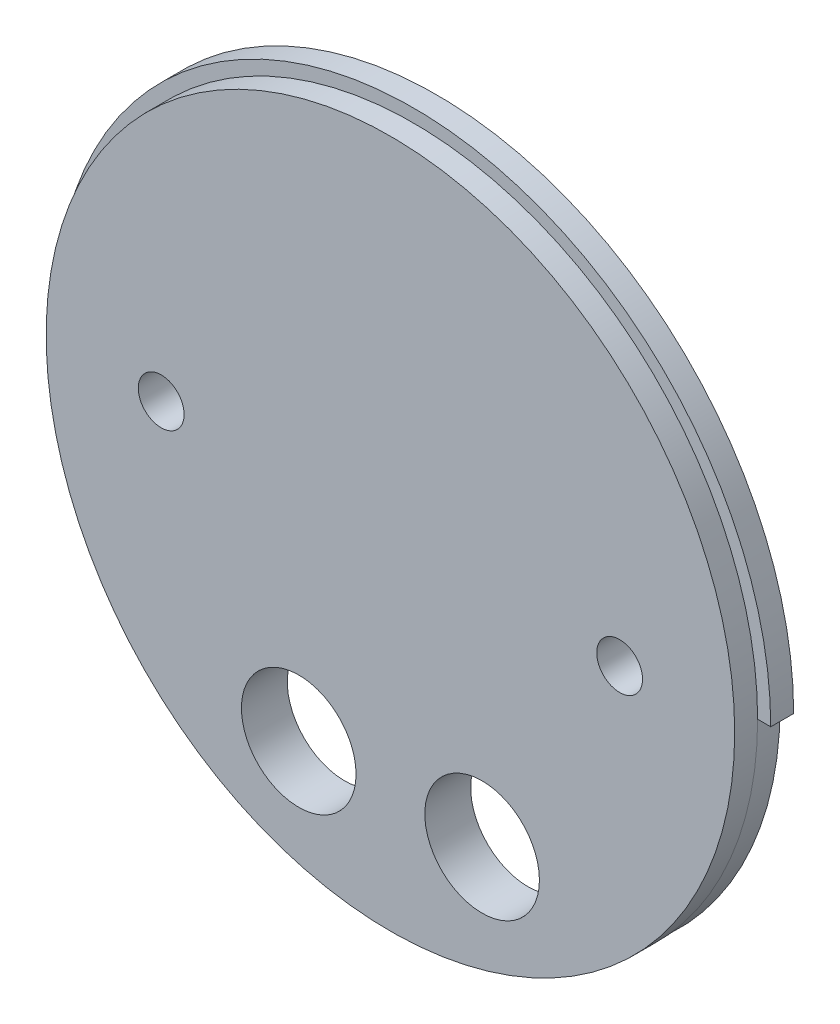
ISO-10303-21;
HEADER;
FILE_DESCRIPTION(('STEP AP214'),'2;1');
FILE_NAME('part.step','',(''),(''),'','','');
FILE_SCHEMA(('AUTOMOTIVE_DESIGN { 1 0 10303 214 1 1 1 1 }'));
ENDSEC;
DATA;
#1=APPLICATION_CONTEXT('core data for automotive mechanical design processes');
#2=APPLICATION_PROTOCOL_DEFINITION('international standard','automotive_design',2000,#1);
#3=PRODUCT_CONTEXT('',#1,'mechanical');
#4=PRODUCT('Part','Part','',(#3));
#5=PRODUCT_RELATED_PRODUCT_CATEGORY('part','',(#4));
#6=PRODUCT_DEFINITION_FORMATION('','',#4);
#7=PRODUCT_DEFINITION_CONTEXT('part definition',#1,'design');
#8=PRODUCT_DEFINITION('design','',#6,#7);
#9=PRODUCT_DEFINITION_SHAPE('','',#8);
#10=(LENGTH_UNIT() NAMED_UNIT(*) SI_UNIT(.MILLI.,.METRE.));
#11=(NAMED_UNIT(*) PLANE_ANGLE_UNIT() SI_UNIT($,.RADIAN.));
#12=(NAMED_UNIT(*) SI_UNIT($,.STERADIAN.) SOLID_ANGLE_UNIT());
#13=UNCERTAINTY_MEASURE_WITH_UNIT(LENGTH_MEASURE(1.E-05),#10,'distance_accuracy_value','');
#14=(GEOMETRIC_REPRESENTATION_CONTEXT(3) GLOBAL_UNCERTAINTY_ASSIGNED_CONTEXT((#13)) GLOBAL_UNIT_ASSIGNED_CONTEXT((#10,
#11,#12)) REPRESENTATION_CONTEXT('',''));
#15=CARTESIAN_POINT('',(0.,0.,0.));
#16=DIRECTION('',(0.,0.,1.));
#17=DIRECTION('',(1.,0.,0.));
#18=AXIS2_PLACEMENT_3D('',#15,#16,#17);
#19=CARTESIAN_POINT('',(0.,0.,3.175));
#20=DIRECTION('',(0.,0.,-1.));
#21=DIRECTION('',(-1.,0.,0.));
#22=AXIS2_PLACEMENT_3D('',#19,#20,#21);
#23=CYLINDRICAL_SURFACE('',#22,49.5046);
#24=CARTESIAN_POINT('',(0.,0.,3.175));
#25=DIRECTION('',(0.,0.,1.));
#26=DIRECTION('',(1.,0.,0.));
#27=AXIS2_PLACEMENT_3D('',#24,#25,#26);
#28=CIRCLE('',#27,49.5046);
#29=CARTESIAN_POINT('',(49.5046,0.,3.175));
#30=VERTEX_POINT('',#29);
#31=CARTESIAN_POINT('',(-49.5046,0.,3.175));
#32=VERTEX_POINT('',#31);
#33=EDGE_CURVE('E148',#30,#32,#28,.T.);
#34=ORIENTED_EDGE('',*,*,#33,.F.);
#35=DIRECTION('',(0.,0.,-1.));
#36=VECTOR('',#35,1.);
#37=CARTESIAN_POINT('',(49.5046,0.,3.175));
#38=LINE('',#37,#36);
#39=CARTESIAN_POINT('',(49.5046,0.,0.));
#40=VERTEX_POINT('',#39);
#41=EDGE_CURVE('E115',#30,#40,#38,.T.);
#42=ORIENTED_EDGE('',*,*,#41,.T.);
#43=CARTESIAN_POINT('',(0.,0.,0.));
#44=DIRECTION('',(0.,0.,1.));
#45=DIRECTION('',(1.,0.,0.));
#46=AXIS2_PLACEMENT_3D('',#43,#44,#45);
#47=CIRCLE('',#46,49.5046);
#48=CARTESIAN_POINT('',(-49.5046,0.,0.));
#49=VERTEX_POINT('',#48);
#50=EDGE_CURVE('E144',#40,#49,#47,.T.);
#51=ORIENTED_EDGE('',*,*,#50,.T.);
#52=DIRECTION('',(0.,0.,-1.));
#53=VECTOR('',#52,1.);
#54=CARTESIAN_POINT('',(-49.5046,0.,3.175));
#55=LINE('',#54,#53);
#56=EDGE_CURVE('E99',#49,#32,#55,.F.);
#57=ORIENTED_EDGE('',*,*,#56,.T.);
#58=EDGE_LOOP('',(#34,#42,#51,#57));
#59=FACE_BOUND('',#58,.T.);
#60=ADVANCED_FACE('F39',(#59),#23,.T.);
#61=CARTESIAN_POINT('',(0.,0.,3.175));
#62=DIRECTION('',(0.,0.,1.));
#63=DIRECTION('',(1.,0.,0.));
#64=AXIS2_PLACEMENT_3D('',#61,#62,#63);
#65=PLANE('',#64);
#66=DIRECTION('',(-1.,0.,0.));
#67=VECTOR('',#66,1.);
#68=CARTESIAN_POINT('',(47.625,0.,3.175));
#69=LINE('',#68,#67);
#70=CARTESIAN_POINT('',(47.6885,0.,3.175));
#71=VERTEX_POINT('',#70);
#72=EDGE_CURVE('E53',#30,#71,#69,.T.);
#73=ORIENTED_EDGE('',*,*,#72,.F.);
#74=ORIENTED_EDGE('',*,*,#33,.T.);
#75=DIRECTION('',(-1.,0.,0.));
#76=VECTOR('',#75,1.);
#77=CARTESIAN_POINT('',(-50.165,0.,3.175));
#78=LINE('',#77,#76);
#79=CARTESIAN_POINT('',(-47.6885,0.,3.175));
#80=VERTEX_POINT('',#79);
#81=EDGE_CURVE('E110',#80,#32,#78,.T.);
#82=ORIENTED_EDGE('',*,*,#81,.F.);
#83=CARTESIAN_POINT('',(0.,0.,3.175));
#84=DIRECTION('',(0.,0.,1.));
#85=DIRECTION('',(1.,0.,0.));
#86=AXIS2_PLACEMENT_3D('',#83,#84,#85);
#87=CIRCLE('',#86,47.6885);
#88=EDGE_CURVE('E46',#71,#80,#87,.T.);
#89=ORIENTED_EDGE('',*,*,#88,.F.);
#90=EDGE_LOOP('',(#73,#74,#82,#89));
#91=FACE_BOUND('',#90,.T.);
#92=ADVANCED_FACE('F155',(#91),#65,.T.);
#93=CARTESIAN_POINT('',(0.,0.,0.));
#94=DIRECTION('',(0.,0.,1.));
#95=DIRECTION('',(1.,0.,0.));
#96=AXIS2_PLACEMENT_3D('',#93,#94,#95);
#97=PLANE('',#96);
#98=CARTESIAN_POINT('',(-31.75,0.,0.));
#99=DIRECTION('',(0.,0.,1.));
#100=DIRECTION('',(1.,0.,0.));
#101=AXIS2_PLACEMENT_3D('',#98,#99,#100);
#102=CIRCLE('',#101,3.17500000000001);
#103=CARTESIAN_POINT('',(-28.575,0.,0.));
#104=VERTEX_POINT('',#103);
#105=EDGE_CURVE('E118',#104,#104,#102,.T.);
#106=ORIENTED_EDGE('',*,*,#105,.T.);
#107=EDGE_LOOP('',(#106));
#108=FACE_BOUND('',#107,.T.);
#109=CARTESIAN_POINT('',(12.7,-31.2353524431853,0.));
#110=DIRECTION('',(0.,0.,1.));
#111=DIRECTION('',(1.,0.,0.));
#112=AXIS2_PLACEMENT_3D('',#109,#110,#111);
#113=CIRCLE('',#112,7.9375);
#114=CARTESIAN_POINT('',(20.6375,-31.2353524431853,0.));
#115=VERTEX_POINT('',#114);
#116=EDGE_CURVE('E126',#115,#115,#113,.T.);
#117=ORIENTED_EDGE('',*,*,#116,.T.);
#118=EDGE_LOOP('',(#117));
#119=FACE_BOUND('',#118,.T.);
#120=CARTESIAN_POINT('',(-12.7,-31.2353524431853,0.));
#121=DIRECTION('',(0.,0.,1.));
#122=DIRECTION('',(1.,0.,0.));
#123=AXIS2_PLACEMENT_3D('',#120,#121,#122);
#124=CIRCLE('',#123,7.9375);
#125=CARTESIAN_POINT('',(-4.7625,-31.2353524431853,0.));
#126=VERTEX_POINT('',#125);
#127=EDGE_CURVE('E137',#126,#126,#124,.T.);
#128=ORIENTED_EDGE('',*,*,#127,.T.);
#129=EDGE_LOOP('',(#128));
#130=FACE_BOUND('',#129,.T.);
#131=CARTESIAN_POINT('',(31.75,0.,0.));
#132=DIRECTION('',(0.,0.,1.));
#133=DIRECTION('',(1.,0.,0.));
#134=AXIS2_PLACEMENT_3D('',#131,#132,#133);
#135=CIRCLE('',#134,3.17500000000001);
#136=CARTESIAN_POINT('',(34.925,0.,0.));
#137=VERTEX_POINT('',#136);
#138=EDGE_CURVE('E125',#137,#137,#135,.T.);
#139=ORIENTED_EDGE('',*,*,#138,.T.);
#140=EDGE_LOOP('',(#139));
#141=FACE_BOUND('',#140,.T.);
#142=ORIENTED_EDGE('',*,*,#50,.F.);
#143=DIRECTION('',(-1.,0.,0.));
#144=VECTOR('',#143,1.);
#145=CARTESIAN_POINT('',(0.,0.,0.));
#146=LINE('',#145,#144);
#147=CARTESIAN_POINT('',(47.625,0.,0.));
#148=VERTEX_POINT('',#147);
#149=EDGE_CURVE('E11',#40,#148,#146,.T.);
#150=ORIENTED_EDGE('',*,*,#149,.T.);
#151=CARTESIAN_POINT('',(0.,0.,0.));
#152=DIRECTION('',(0.,0.,-1.));
#153=DIRECTION('',(1.,0.,0.));
#154=AXIS2_PLACEMENT_3D('',#151,#152,#153);
#155=CIRCLE('',#154,47.625);
#156=CARTESIAN_POINT('',(-47.625,0.,0.));
#157=VERTEX_POINT('',#156);
#158=EDGE_CURVE('E87',#148,#157,#155,.T.);
#159=ORIENTED_EDGE('',*,*,#158,.T.);
#160=DIRECTION('',(-1.,0.,0.));
#161=VECTOR('',#160,1.);
#162=CARTESIAN_POINT('',(-50.165,0.,0.));
#163=LINE('',#162,#161);
#164=EDGE_CURVE('E94',#157,#49,#163,.T.);
#165=ORIENTED_EDGE('',*,*,#164,.T.);
#166=EDGE_LOOP('',(#142,#150,#159,#165));
#167=FACE_BOUND('',#166,.T.);
#168=ADVANCED_FACE('F104',(#108,#119,#130,#141,#167),#97,.F.);
#169=CARTESIAN_POINT('',(0.,0.,6.35));
#170=DIRECTION('',(0.,0.,-1.));
#171=DIRECTION('',(-1.,0.,0.));
#172=AXIS2_PLACEMENT_3D('',#169,#170,#171);
#173=CYLINDRICAL_SURFACE('',#172,47.6885);
#174=CARTESIAN_POINT('',(0.,0.,6.35));
#175=DIRECTION('',(0.,0.,1.));
#176=DIRECTION('',(1.,0.,0.));
#177=AXIS2_PLACEMENT_3D('',#174,#175,#176);
#178=CIRCLE('',#177,47.6885);
#179=CARTESIAN_POINT('',(47.6885,0.,6.35));
#180=VERTEX_POINT('',#179);
#181=EDGE_CURVE('E121',#180,#180,#178,.T.);
#182=ORIENTED_EDGE('',*,*,#181,.F.);
#183=EDGE_LOOP('',(#182));
#184=FACE_BOUND('',#183,.T.);
#185=ORIENTED_EDGE('',*,*,#88,.T.);
#186=EDGE_CURVE('E147',#80,#71,#87,.T.);
#187=ORIENTED_EDGE('',*,*,#186,.T.);
#188=EDGE_LOOP('',(#185,#187));
#189=FACE_BOUND('',#188,.T.);
#190=ADVANCED_FACE('F159',(#184,#189),#173,.T.);
#191=CARTESIAN_POINT('',(0.,0.,6.35));
#192=DIRECTION('',(0.,0.,1.));
#193=DIRECTION('',(1.,0.,0.));
#194=AXIS2_PLACEMENT_3D('',#191,#192,#193);
#195=PLANE('',#194);
#196=CARTESIAN_POINT('',(-31.75,0.,6.35));
#197=DIRECTION('',(0.,0.,1.));
#198=DIRECTION('',(1.,0.,0.));
#199=AXIS2_PLACEMENT_3D('',#196,#197,#198);
#200=CIRCLE('',#199,3.17500000000001);
#201=CARTESIAN_POINT('',(-28.575,0.,6.35));
#202=VERTEX_POINT('',#201);
#203=EDGE_CURVE('E122',#202,#202,#200,.T.);
#204=ORIENTED_EDGE('',*,*,#203,.F.);
#205=EDGE_LOOP('',(#204));
#206=FACE_BOUND('',#205,.T.);
#207=CARTESIAN_POINT('',(12.7,-31.2353524431853,6.35));
#208=DIRECTION('',(0.,0.,1.));
#209=DIRECTION('',(1.,0.,0.));
#210=AXIS2_PLACEMENT_3D('',#207,#208,#209);
#211=CIRCLE('',#210,7.9375);
#212=CARTESIAN_POINT('',(20.6375,-31.2353524431853,6.35));
#213=VERTEX_POINT('',#212);
#214=EDGE_CURVE('E117',#213,#213,#211,.T.);
#215=ORIENTED_EDGE('',*,*,#214,.F.);
#216=EDGE_LOOP('',(#215));
#217=FACE_BOUND('',#216,.T.);
#218=CARTESIAN_POINT('',(-12.7,-31.2353524431853,6.35));
#219=DIRECTION('',(0.,0.,1.));
#220=DIRECTION('',(1.,0.,0.));
#221=AXIS2_PLACEMENT_3D('',#218,#219,#220);
#222=CIRCLE('',#221,7.9375);
#223=CARTESIAN_POINT('',(-4.7625,-31.2353524431853,6.35));
#224=VERTEX_POINT('',#223);
#225=EDGE_CURVE('E129',#224,#224,#222,.T.);
#226=ORIENTED_EDGE('',*,*,#225,.F.);
#227=EDGE_LOOP('',(#226));
#228=FACE_BOUND('',#227,.T.);
#229=CARTESIAN_POINT('',(31.75,0.,6.35));
#230=DIRECTION('',(0.,0.,1.));
#231=DIRECTION('',(1.,0.,0.));
#232=AXIS2_PLACEMENT_3D('',#229,#230,#231);
#233=CIRCLE('',#232,3.17500000000001);
#234=CARTESIAN_POINT('',(34.925,0.,6.35));
#235=VERTEX_POINT('',#234);
#236=EDGE_CURVE('E134',#235,#235,#233,.T.);
#237=ORIENTED_EDGE('',*,*,#236,.F.);
#238=EDGE_LOOP('',(#237));
#239=FACE_BOUND('',#238,.T.);
#240=ORIENTED_EDGE('',*,*,#181,.T.);
#241=EDGE_LOOP('',(#240));
#242=FACE_BOUND('',#241,.T.);
#243=ADVANCED_FACE('F183',(#206,#217,#228,#239,#242),#195,.T.);
#244=CARTESIAN_POINT('',(31.75,0.,0.));
#245=DIRECTION('',(0.,0.,1.));
#246=DIRECTION('',(1.,0.,0.));
#247=AXIS2_PLACEMENT_3D('',#244,#245,#246);
#248=CYLINDRICAL_SURFACE('',#247,3.17500000000001);
#249=ORIENTED_EDGE('',*,*,#138,.F.);
#250=EDGE_LOOP('',(#249));
#251=FACE_BOUND('',#250,.T.);
#252=ORIENTED_EDGE('',*,*,#236,.T.);
#253=EDGE_LOOP('',(#252));
#254=FACE_BOUND('',#253,.T.);
#255=ADVANCED_FACE('F187',(#251,#254),#248,.F.);
#256=CARTESIAN_POINT('',(-12.7,-31.2353524431853,0.));
#257=DIRECTION('',(0.,0.,1.));
#258=DIRECTION('',(1.,0.,0.));
#259=AXIS2_PLACEMENT_3D('',#256,#257,#258);
#260=CYLINDRICAL_SURFACE('',#259,7.9375);
#261=ORIENTED_EDGE('',*,*,#127,.F.);
#262=EDGE_LOOP('',(#261));
#263=FACE_BOUND('',#262,.T.);
#264=ORIENTED_EDGE('',*,*,#225,.T.);
#265=EDGE_LOOP('',(#264));
#266=FACE_BOUND('',#265,.T.);
#267=ADVANCED_FACE('F189',(#263,#266),#260,.F.);
#268=CARTESIAN_POINT('',(12.7,-31.2353524431853,0.));
#269=DIRECTION('',(0.,0.,1.));
#270=DIRECTION('',(1.,0.,0.));
#271=AXIS2_PLACEMENT_3D('',#268,#269,#270);
#272=CYLINDRICAL_SURFACE('',#271,7.9375);
#273=ORIENTED_EDGE('',*,*,#116,.F.);
#274=EDGE_LOOP('',(#273));
#275=FACE_BOUND('',#274,.T.);
#276=ORIENTED_EDGE('',*,*,#214,.T.);
#277=EDGE_LOOP('',(#276));
#278=FACE_BOUND('',#277,.T.);
#279=ADVANCED_FACE('F192',(#275,#278),#272,.F.);
#280=CARTESIAN_POINT('',(-31.75,0.,0.));
#281=DIRECTION('',(0.,0.,1.));
#282=DIRECTION('',(1.,0.,0.));
#283=AXIS2_PLACEMENT_3D('',#280,#281,#282);
#284=CYLINDRICAL_SURFACE('',#283,3.17500000000001);
#285=ORIENTED_EDGE('',*,*,#105,.F.);
#286=EDGE_LOOP('',(#285));
#287=FACE_BOUND('',#286,.T.);
#288=ORIENTED_EDGE('',*,*,#203,.T.);
#289=EDGE_LOOP('',(#288));
#290=FACE_BOUND('',#289,.T.);
#291=ADVANCED_FACE('F199',(#287,#290),#284,.F.);
#292=CARTESIAN_POINT('',(47.625,0.,0.));
#293=DIRECTION('',(0.,1.,0.));
#294=DIRECTION('',(0.,0.,1.));
#295=AXIS2_PLACEMENT_3D('',#292,#293,#294);
#296=PLANE('',#295);
#297=ORIENTED_EDGE('',*,*,#72,.T.);
#298=CARTESIAN_POINT('',(47.625,0.,3.175));
#299=VERTEX_POINT('',#298);
#300=EDGE_CURVE('E106',#71,#299,#69,.T.);
#301=ORIENTED_EDGE('',*,*,#300,.T.);
#302=DIRECTION('',(0.,0.,1.));
#303=VECTOR('',#302,1.);
#304=CARTESIAN_POINT('',(47.625,0.,0.));
#305=LINE('',#304,#303);
#306=EDGE_CURVE('E93',#148,#299,#305,.T.);
#307=ORIENTED_EDGE('',*,*,#306,.F.);
#308=ORIENTED_EDGE('',*,*,#149,.F.);
#309=ORIENTED_EDGE('',*,*,#41,.F.);
#310=EDGE_LOOP('',(#297,#301,#307,#308,#309));
#311=FACE_BOUND('',#310,.T.);
#312=ADVANCED_FACE('F152',(#311),#296,.F.);
#313=CARTESIAN_POINT('',(-50.165,0.,0.));
#314=DIRECTION('',(0.,1.,0.));
#315=DIRECTION('',(0.,0.,1.));
#316=AXIS2_PLACEMENT_3D('',#313,#314,#315);
#317=PLANE('',#316);
#318=ORIENTED_EDGE('',*,*,#164,.F.);
#319=DIRECTION('',(0.,0.,1.));
#320=VECTOR('',#319,1.);
#321=CARTESIAN_POINT('',(-47.625,0.,0.));
#322=LINE('',#321,#320);
#323=CARTESIAN_POINT('',(-47.625,0.,3.175));
#324=VERTEX_POINT('',#323);
#325=EDGE_CURVE('E82',#157,#324,#322,.T.);
#326=ORIENTED_EDGE('',*,*,#325,.T.);
#327=EDGE_CURVE('E111',#324,#80,#78,.T.);
#328=ORIENTED_EDGE('',*,*,#327,.T.);
#329=ORIENTED_EDGE('',*,*,#81,.T.);
#330=ORIENTED_EDGE('',*,*,#56,.F.);
#331=EDGE_LOOP('',(#318,#326,#328,#329,#330));
#332=FACE_BOUND('',#331,.T.);
#333=ADVANCED_FACE('F97',(#332),#317,.F.);
#334=CARTESIAN_POINT('',(0.,0.,3.175));
#335=DIRECTION('',(0.,0.,1.));
#336=DIRECTION('',(1.,0.,0.));
#337=AXIS2_PLACEMENT_3D('',#334,#335,#336);
#338=PLANE('',#337);
#339=ORIENTED_EDGE('',*,*,#327,.F.);
#340=CARTESIAN_POINT('',(0.,0.,3.175));
#341=DIRECTION('',(0.,0.,-1.));
#342=DIRECTION('',(1.,0.,0.));
#343=AXIS2_PLACEMENT_3D('',#340,#341,#342);
#344=CIRCLE('',#343,47.625);
#345=EDGE_CURVE('E89',#299,#324,#344,.T.);
#346=ORIENTED_EDGE('',*,*,#345,.F.);
#347=ORIENTED_EDGE('',*,*,#300,.F.);
#348=ORIENTED_EDGE('',*,*,#186,.F.);
#349=EDGE_LOOP('',(#339,#346,#347,#348));
#350=FACE_BOUND('',#349,.T.);
#351=ADVANCED_FACE('F161',(#350),#338,.F.);
#352=CARTESIAN_POINT('',(0.,0.,0.));
#353=DIRECTION('',(0.,0.,1.));
#354=DIRECTION('',(1.,0.,0.));
#355=AXIS2_PLACEMENT_3D('',#352,#353,#354);
#356=CYLINDRICAL_SURFACE('',#355,47.625);
#357=ORIENTED_EDGE('',*,*,#345,.T.);
#358=ORIENTED_EDGE('',*,*,#325,.F.);
#359=ORIENTED_EDGE('',*,*,#158,.F.);
#360=ORIENTED_EDGE('',*,*,#306,.T.);
#361=EDGE_LOOP('',(#357,#358,#359,#360));
#362=FACE_BOUND('',#361,.T.);
#363=ADVANCED_FACE('F84',(#362),#356,.T.);
#364=CLOSED_SHELL('',(#60,#92,#168,#190,#243,#255,#267,#279,#291,#312,#333,#351,#363));
#365=MANIFOLD_SOLID_BREP('B2',#364);
#366=ADVANCED_BREP_SHAPE_REPRESENTATION('',(#18,#365),#14);
#367=SHAPE_DEFINITION_REPRESENTATION(#9,#366);
ENDSEC;
END-ISO-10303-21;
